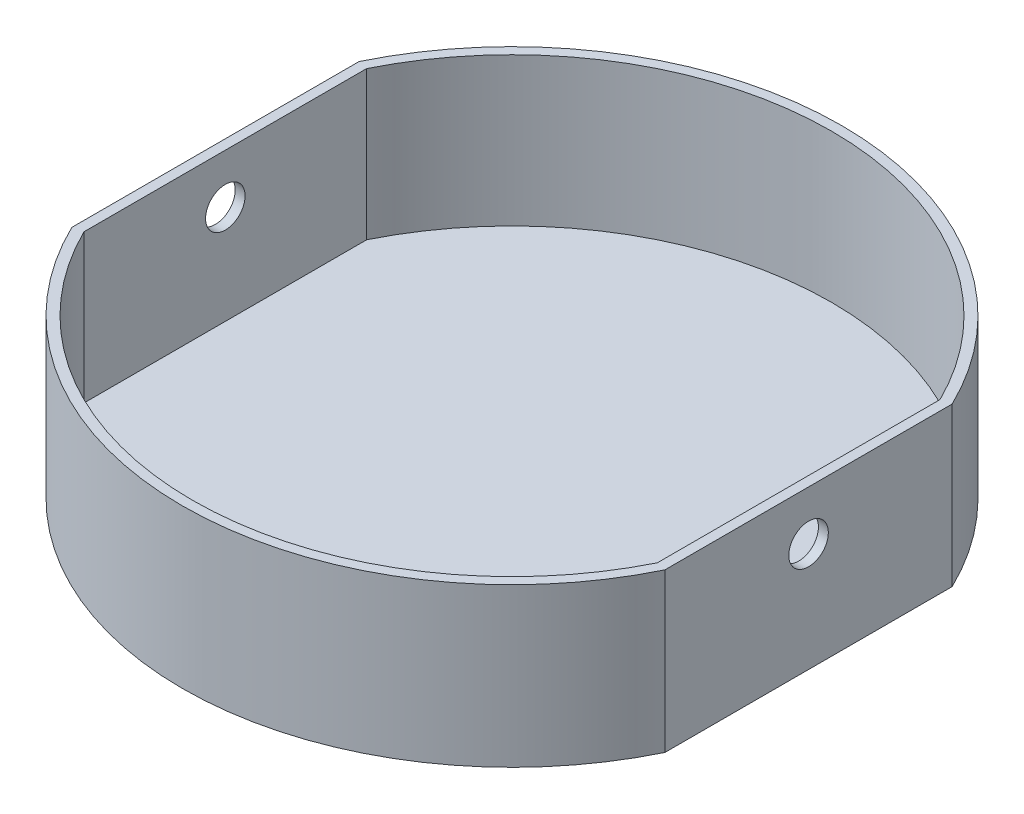
ISO-10303-21;
HEADER;
FILE_DESCRIPTION(('STEP AP214'),'2;1');
FILE_NAME('part.step','',(''),(''),'','','');
FILE_SCHEMA(('AUTOMOTIVE_DESIGN { 1 0 10303 214 1 1 1 1 }'));
ENDSEC;
DATA;
#1=APPLICATION_CONTEXT('core data for automotive mechanical design processes');
#2=APPLICATION_PROTOCOL_DEFINITION('international standard','automotive_design',2000,#1);
#3=PRODUCT_CONTEXT('',#1,'mechanical');
#4=PRODUCT('Part','Part','',(#3));
#5=PRODUCT_RELATED_PRODUCT_CATEGORY('part','',(#4));
#6=PRODUCT_DEFINITION_FORMATION('','',#4);
#7=PRODUCT_DEFINITION_CONTEXT('part definition',#1,'design');
#8=PRODUCT_DEFINITION('design','',#6,#7);
#9=PRODUCT_DEFINITION_SHAPE('','',#8);
#10=(LENGTH_UNIT() NAMED_UNIT(*) SI_UNIT(.MILLI.,.METRE.));
#11=(NAMED_UNIT(*) PLANE_ANGLE_UNIT() SI_UNIT($,.RADIAN.));
#12=(NAMED_UNIT(*) SI_UNIT($,.STERADIAN.) SOLID_ANGLE_UNIT());
#13=UNCERTAINTY_MEASURE_WITH_UNIT(LENGTH_MEASURE(1.E-05),#10,'distance_accuracy_value','');
#14=(GEOMETRIC_REPRESENTATION_CONTEXT(3) GLOBAL_UNCERTAINTY_ASSIGNED_CONTEXT((#13)) GLOBAL_UNIT_ASSIGNED_CONTEXT((#10,
#11,#12)) REPRESENTATION_CONTEXT('',''));
#15=CARTESIAN_POINT('',(0.,0.,0.));
#16=DIRECTION('',(0.,0.,1.));
#17=DIRECTION('',(1.,0.,0.));
#18=AXIS2_PLACEMENT_3D('',#15,#16,#17);
#19=CARTESIAN_POINT('',(0.,48.,0.));
#20=DIRECTION('',(0.,1.,0.));
#21=DIRECTION('',(0.,0.,1.));
#22=AXIS2_PLACEMENT_3D('',#19,#20,#21);
#23=PLANE('',#22);
#24=CARTESIAN_POINT('',(0.,48.,0.));
#25=DIRECTION('',(0.,1.,0.));
#26=DIRECTION('',(0.,0.,1.));
#27=AXIS2_PLACEMENT_3D('',#24,#25,#26);
#28=CIRCLE('',#27,100.);
#29=CARTESIAN_POINT('',(-90.0859820491556,48.,43.4110105645932));
#30=VERTEX_POINT('',#29);
#31=CARTESIAN_POINT('',(90.,48.,43.5889894354068));
#32=VERTEX_POINT('',#31);
#33=EDGE_CURVE('E209',#30,#32,#28,.T.);
#34=ORIENTED_EDGE('',*,*,#33,.T.);
#35=DIRECTION('',(0.,0.,1.));
#36=VECTOR('',#35,1.);
#37=CARTESIAN_POINT('',(90.,48.,-43.5889894354068));
#38=LINE('',#37,#36);
#39=CARTESIAN_POINT('',(90.,48.,-43.5889894354068));
#40=VERTEX_POINT('',#39);
#41=EDGE_CURVE('E233',#40,#32,#38,.T.);
#42=ORIENTED_EDGE('',*,*,#41,.F.);
#43=CARTESIAN_POINT('',(0.,48.,2.63677968348475E-13));
#44=DIRECTION('',(0.,1.,0.));
#45=DIRECTION('',(0.,0.,-1.));
#46=AXIS2_PLACEMENT_3D('',#43,#44,#45);
#47=CIRCLE('',#46,100.);
#48=CARTESIAN_POINT('',(-90.,48.,-43.5889894354068));
#49=VERTEX_POINT('',#48);
#50=EDGE_CURVE('E203',#40,#49,#47,.T.);
#51=ORIENTED_EDGE('',*,*,#50,.T.);
#52=DIRECTION('',(0.,0.,1.));
#53=VECTOR('',#52,1.);
#54=CARTESIAN_POINT('',(-90.,48.,-43.5889894354068));
#55=LINE('',#54,#53);
#56=CARTESIAN_POINT('',(-90.,48.,43.4110105645932));
#57=VERTEX_POINT('',#56);
#58=EDGE_CURVE('E226',#49,#57,#55,.T.);
#59=ORIENTED_EDGE('',*,*,#58,.T.);
#60=DIRECTION('',(-1.,0.,0.));
#61=VECTOR('',#60,1.);
#62=CARTESIAN_POINT('',(-87.,48.,43.4110105645932));
#63=LINE('',#62,#61);
#64=EDGE_CURVE('E205',#57,#30,#63,.T.);
#65=ORIENTED_EDGE('',*,*,#64,.T.);
#66=EDGE_LOOP('',(#34,#42,#51,#59,#65));
#67=FACE_BOUND('',#66,.T.);
#68=DIRECTION('',(0.,0.,1.));
#69=VECTOR('',#68,1.);
#70=CARTESIAN_POINT('',(87.,48.,-42.8952211790544));
#71=LINE('',#70,#69);
#72=CARTESIAN_POINT('',(87.,48.,-42.8952211790544));
#73=VERTEX_POINT('',#72);
#74=CARTESIAN_POINT('',(87.,48.,42.8952211790544));
#75=VERTEX_POINT('',#74);
#76=EDGE_CURVE('E200',#73,#75,#71,.T.);
#77=ORIENTED_EDGE('',*,*,#76,.T.);
#78=CARTESIAN_POINT('',(0.,48.,0.));
#79=DIRECTION('',(0.,1.,0.));
#80=DIRECTION('',(0.,0.,1.));
#81=AXIS2_PLACEMENT_3D('',#78,#79,#80);
#82=CIRCLE('',#81,97.);
#83=CARTESIAN_POINT('',(-87.,48.,42.8952211790545));
#84=VERTEX_POINT('',#83);
#85=EDGE_CURVE('E166',#84,#75,#82,.T.);
#86=ORIENTED_EDGE('',*,*,#85,.F.);
#87=DIRECTION('',(0.,0.,1.));
#88=VECTOR('',#87,1.);
#89=CARTESIAN_POINT('',(-87.,48.,-42.8952211790544));
#90=LINE('',#89,#88);
#91=CARTESIAN_POINT('',(-87.,48.,-42.8952211790544));
#92=VERTEX_POINT('',#91);
#93=EDGE_CURVE('E161',#92,#84,#90,.T.);
#94=ORIENTED_EDGE('',*,*,#93,.F.);
#95=CARTESIAN_POINT('',(0.,48.,2.63677968348475E-13));
#96=DIRECTION('',(0.,1.,0.));
#97=DIRECTION('',(0.,0.,1.));
#98=AXIS2_PLACEMENT_3D('',#95,#96,#97);
#99=CIRCLE('',#98,97.0000000000001);
#100=EDGE_CURVE('E145',#73,#92,#99,.T.);
#101=ORIENTED_EDGE('',*,*,#100,.F.);
#102=EDGE_LOOP('',(#77,#86,#94,#101));
#103=FACE_BOUND('',#102,.T.);
#104=ADVANCED_FACE('F72',(#67,#103),#23,.T.);
#105=CARTESIAN_POINT('',(0.,3.,0.));
#106=DIRECTION('',(0.,-1.,0.));
#107=DIRECTION('',(0.,0.,-1.));
#108=AXIS2_PLACEMENT_3D('',#105,#106,#107);
#109=CYLINDRICAL_SURFACE('',#108,100.);
#110=CARTESIAN_POINT('',(0.,0.,0.));
#111=DIRECTION('',(0.,1.,0.));
#112=DIRECTION('',(0.,0.,1.));
#113=AXIS2_PLACEMENT_3D('',#110,#111,#112);
#114=CIRCLE('',#113,100.);
#115=CARTESIAN_POINT('',(90.,0.,-43.5889894354068));
#116=VERTEX_POINT('',#115);
#117=CARTESIAN_POINT('',(-90.,0.,-43.5889894354068));
#118=VERTEX_POINT('',#117);
#119=EDGE_CURVE('E238',#116,#118,#114,.T.);
#120=ORIENTED_EDGE('',*,*,#119,.T.);
#121=DIRECTION('',(0.,-1.,0.));
#122=VECTOR('',#121,1.);
#123=CARTESIAN_POINT('',(-90.,48.,-43.5889894354068));
#124=LINE('',#123,#122);
#125=EDGE_CURVE('E229',#49,#118,#124,.T.);
#126=ORIENTED_EDGE('',*,*,#125,.F.);
#127=ORIENTED_EDGE('',*,*,#50,.F.);
#128=DIRECTION('',(0.,-1.,0.));
#129=VECTOR('',#128,1.);
#130=CARTESIAN_POINT('',(90.,48.,-43.5889894354068));
#131=LINE('',#130,#129);
#132=EDGE_CURVE('E236',#40,#116,#131,.T.);
#133=ORIENTED_EDGE('',*,*,#132,.T.);
#134=EDGE_LOOP('',(#120,#126,#127,#133));
#135=FACE_BOUND('',#134,.T.);
#136=ADVANCED_FACE('F259',(#135),#109,.T.);
#137=DIRECTION('',(0.,-1.,0.));
#138=VECTOR('',#137,1.);
#139=CARTESIAN_POINT('',(90.,3.,43.5889894354068));
#140=LINE('',#139,#138);
#141=CARTESIAN_POINT('',(90.,0.,43.5889894354068));
#142=VERTEX_POINT('',#141);
#143=EDGE_CURVE('E224',#142,#32,#140,.F.);
#144=ORIENTED_EDGE('',*,*,#143,.T.);
#145=ORIENTED_EDGE('',*,*,#33,.F.);
#146=DIRECTION('',(0.,-1.,0.));
#147=VECTOR('',#146,1.);
#148=CARTESIAN_POINT('',(-90.0859820491555,3.,43.4110105645932));
#149=LINE('',#148,#147);
#150=CARTESIAN_POINT('',(-90.0859820491556,0.,43.4110105645932));
#151=VERTEX_POINT('',#150);
#152=EDGE_CURVE('E222',#30,#151,#149,.T.);
#153=ORIENTED_EDGE('',*,*,#152,.T.);
#154=EDGE_CURVE('E95',#151,#142,#114,.T.);
#155=ORIENTED_EDGE('',*,*,#154,.T.);
#156=EDGE_LOOP('',(#144,#145,#153,#155));
#157=FACE_BOUND('',#156,.T.);
#158=ADVANCED_FACE('F74',(#157),#109,.T.);
#159=CARTESIAN_POINT('',(0.,0.,0.));
#160=DIRECTION('',(0.,1.,0.));
#161=DIRECTION('',(0.,0.,1.));
#162=AXIS2_PLACEMENT_3D('',#159,#160,#161);
#163=PLANE('',#162);
#164=DIRECTION('',(1.,0.,0.));
#165=VECTOR('',#164,1.);
#166=CARTESIAN_POINT('',(0.,0.,43.4110105645932));
#167=LINE('',#166,#165);
#168=CARTESIAN_POINT('',(-90.,0.,43.4110105645932));
#169=VERTEX_POINT('',#168);
#170=EDGE_CURVE('E80',#151,#169,#167,.T.);
#171=ORIENTED_EDGE('',*,*,#170,.T.);
#172=DIRECTION('',(0.,0.,-1.));
#173=VECTOR('',#172,1.);
#174=CARTESIAN_POINT('',(-90.,0.,0.));
#175=LINE('',#174,#173);
#176=EDGE_CURVE('E12',#169,#118,#175,.T.);
#177=ORIENTED_EDGE('',*,*,#176,.T.);
#178=ORIENTED_EDGE('',*,*,#119,.F.);
#179=DIRECTION('',(0.,0.,1.));
#180=VECTOR('',#179,1.);
#181=CARTESIAN_POINT('',(90.,0.,0.));
#182=LINE('',#181,#180);
#183=EDGE_CURVE('E241',#116,#142,#182,.T.);
#184=ORIENTED_EDGE('',*,*,#183,.T.);
#185=ORIENTED_EDGE('',*,*,#154,.F.);
#186=EDGE_LOOP('',(#171,#177,#178,#184,#185));
#187=FACE_BOUND('',#186,.T.);
#188=ADVANCED_FACE('F245',(#187),#163,.F.);
#189=CARTESIAN_POINT('',(90.,48.,-43.5889894354068));
#190=DIRECTION('',(1.,0.,0.));
#191=DIRECTION('',(0.,0.,-1.));
#192=AXIS2_PLACEMENT_3D('',#189,#190,#191);
#193=PLANE('',#192);
#194=CARTESIAN_POINT('',(90.,33.,0.));
#195=DIRECTION('',(1.,0.,0.));
#196=DIRECTION('',(0.,0.,-1.));
#197=AXIS2_PLACEMENT_3D('',#194,#195,#196);
#198=CIRCLE('',#197,6.);
#199=CARTESIAN_POINT('',(90.,33.,-6.00000000000001));
#200=VERTEX_POINT('',#199);
#201=EDGE_CURVE('E212',#200,#200,#198,.T.);
#202=ORIENTED_EDGE('',*,*,#201,.F.);
#203=EDGE_LOOP('',(#202));
#204=FACE_BOUND('',#203,.T.);
#205=ORIENTED_EDGE('',*,*,#41,.T.);
#206=ORIENTED_EDGE('',*,*,#143,.F.);
#207=ORIENTED_EDGE('',*,*,#183,.F.);
#208=ORIENTED_EDGE('',*,*,#132,.F.);
#209=EDGE_LOOP('',(#205,#206,#207,#208));
#210=FACE_BOUND('',#209,.T.);
#211=ADVANCED_FACE('F263',(#204,#210),#193,.T.);
#212=CARTESIAN_POINT('',(-90.,48.,-43.5889894354068));
#213=DIRECTION('',(1.,0.,0.));
#214=DIRECTION('',(0.,0.,-1.));
#215=AXIS2_PLACEMENT_3D('',#212,#213,#214);
#216=PLANE('',#215);
#217=CARTESIAN_POINT('',(-90.,33.,0.));
#218=DIRECTION('',(-1.,0.,0.));
#219=DIRECTION('',(0.,0.,1.));
#220=AXIS2_PLACEMENT_3D('',#217,#218,#219);
#221=CIRCLE('',#220,6.);
#222=CARTESIAN_POINT('',(-90.,33.,6.00000000000003));
#223=VERTEX_POINT('',#222);
#224=EDGE_CURVE('E217',#223,#223,#221,.T.);
#225=ORIENTED_EDGE('',*,*,#224,.F.);
#226=EDGE_LOOP('',(#225));
#227=FACE_BOUND('',#226,.T.);
#228=ORIENTED_EDGE('',*,*,#125,.T.);
#229=ORIENTED_EDGE('',*,*,#176,.F.);
#230=DIRECTION('',(0.,-1.,0.));
#231=VECTOR('',#230,1.);
#232=CARTESIAN_POINT('',(-90.,48.,43.4110105645932));
#233=LINE('',#232,#231);
#234=EDGE_CURVE('E231',#57,#169,#233,.T.);
#235=ORIENTED_EDGE('',*,*,#234,.F.);
#236=ORIENTED_EDGE('',*,*,#58,.F.);
#237=EDGE_LOOP('',(#228,#229,#235,#236));
#238=FACE_BOUND('',#237,.T.);
#239=ADVANCED_FACE('F257',(#227,#238),#216,.F.);
#240=CARTESIAN_POINT('',(-90.,-42.,43.4110105645932));
#241=DIRECTION('',(0.,0.,1.));
#242=DIRECTION('',(1.,0.,0.));
#243=AXIS2_PLACEMENT_3D('',#240,#241,#242);
#244=PLANE('',#243);
#245=ORIENTED_EDGE('',*,*,#152,.F.);
#246=ORIENTED_EDGE('',*,*,#64,.F.);
#247=ORIENTED_EDGE('',*,*,#234,.T.);
#248=ORIENTED_EDGE('',*,*,#170,.F.);
#249=EDGE_LOOP('',(#245,#246,#247,#248));
#250=FACE_BOUND('',#249,.T.);
#251=ADVANCED_FACE('F249',(#250),#244,.F.);
#252=CARTESIAN_POINT('',(-45.,33.,0.));
#253=DIRECTION('',(-1.,0.,0.));
#254=DIRECTION('',(0.,0.,1.));
#255=AXIS2_PLACEMENT_3D('',#252,#253,#254);
#256=CYLINDRICAL_SURFACE('',#255,6.);
#257=CARTESIAN_POINT('',(-87.,33.,0.));
#258=DIRECTION('',(1.,0.,0.));
#259=DIRECTION('',(0.,0.,-1.));
#260=AXIS2_PLACEMENT_3D('',#257,#258,#259);
#261=CIRCLE('',#260,6.);
#262=CARTESIAN_POINT('',(-87.,33.,6.00000000000003));
#263=VERTEX_POINT('',#262);
#264=EDGE_CURVE('E155',#263,#263,#261,.F.);
#265=CARTESIAN_POINT('',(-87.,33.,6.00000000000003));
#266=CARTESIAN_POINT('',(-87.03125,33.,6.00000000000003));
#267=CARTESIAN_POINT('',(-87.0625,33.,6.00000000000003));
#268=CARTESIAN_POINT('',(-87.125,33.,6.00000000000003));
#269=CARTESIAN_POINT('',(-87.15625,33.,6.00000000000003));
#270=CARTESIAN_POINT('',(-87.21875,33.,6.00000000000003));
#271=CARTESIAN_POINT('',(-87.25,33.,6.00000000000003));
#272=CARTESIAN_POINT('',(-87.3125,33.,6.00000000000003));
#273=CARTESIAN_POINT('',(-87.34375,33.,6.00000000000003));
#274=CARTESIAN_POINT('',(-87.4062499999999,33.,6.00000000000003));
#275=CARTESIAN_POINT('',(-87.4375,33.,6.00000000000003));
#276=CARTESIAN_POINT('',(-87.5,33.,6.00000000000003));
#277=CARTESIAN_POINT('',(-87.53125,33.,6.00000000000003));
#278=CARTESIAN_POINT('',(-87.59375,33.,6.00000000000003));
#279=CARTESIAN_POINT('',(-87.625,33.,6.00000000000003));
#280=CARTESIAN_POINT('',(-87.6875,33.,6.00000000000003));
#281=CARTESIAN_POINT('',(-87.71875,33.,6.00000000000003));
#282=CARTESIAN_POINT('',(-87.78125,33.,6.00000000000003));
#283=CARTESIAN_POINT('',(-87.8125,33.,6.00000000000003));
#284=CARTESIAN_POINT('',(-87.875,33.,6.00000000000003));
#285=CARTESIAN_POINT('',(-87.90625,33.,6.00000000000003));
#286=CARTESIAN_POINT('',(-87.96875,33.,6.00000000000003));
#287=CARTESIAN_POINT('',(-88.,33.,6.00000000000003));
#288=CARTESIAN_POINT('',(-88.0625,33.,6.00000000000003));
#289=CARTESIAN_POINT('',(-88.09375,33.,6.00000000000003));
#290=CARTESIAN_POINT('',(-88.15625,33.,6.00000000000003));
#291=CARTESIAN_POINT('',(-88.1875,33.,6.00000000000003));
#292=CARTESIAN_POINT('',(-88.25,33.,6.00000000000003));
#293=CARTESIAN_POINT('',(-88.28125,33.,6.00000000000003));
#294=CARTESIAN_POINT('',(-88.34375,33.,6.00000000000003));
#295=CARTESIAN_POINT('',(-88.375,33.,6.00000000000003));
#296=CARTESIAN_POINT('',(-88.4375,33.,6.00000000000003));
#297=CARTESIAN_POINT('',(-88.46875,33.,6.00000000000003));
#298=CARTESIAN_POINT('',(-88.53125,33.,6.00000000000003));
#299=CARTESIAN_POINT('',(-88.5625,33.,6.00000000000003));
#300=CARTESIAN_POINT('',(-88.625,33.,6.00000000000003));
#301=CARTESIAN_POINT('',(-88.65625,33.,6.00000000000003));
#302=CARTESIAN_POINT('',(-88.71875,33.,6.00000000000003));
#303=CARTESIAN_POINT('',(-88.75,33.,6.00000000000003));
#304=CARTESIAN_POINT('',(-88.8125,33.,6.00000000000003));
#305=CARTESIAN_POINT('',(-88.84375,33.,6.00000000000003));
#306=CARTESIAN_POINT('',(-88.90625,33.,6.00000000000003));
#307=CARTESIAN_POINT('',(-88.9375,33.,6.00000000000003));
#308=CARTESIAN_POINT('',(-89.,33.,6.00000000000003));
#309=CARTESIAN_POINT('',(-89.03125,33.,6.00000000000003));
#310=CARTESIAN_POINT('',(-89.09375,33.,6.00000000000003));
#311=CARTESIAN_POINT('',(-89.125,33.,6.00000000000003));
#312=CARTESIAN_POINT('',(-89.1875,33.,6.00000000000003));
#313=CARTESIAN_POINT('',(-89.21875,33.,6.00000000000003));
#314=CARTESIAN_POINT('',(-89.28125,33.,6.00000000000003));
#315=CARTESIAN_POINT('',(-89.3125,33.,6.00000000000003));
#316=CARTESIAN_POINT('',(-89.375,33.,6.00000000000003));
#317=CARTESIAN_POINT('',(-89.40625,33.,6.00000000000003));
#318=CARTESIAN_POINT('',(-89.46875,33.,6.00000000000003));
#319=CARTESIAN_POINT('',(-89.5,33.,6.00000000000003));
#320=CARTESIAN_POINT('',(-89.5625,33.,6.00000000000003));
#321=CARTESIAN_POINT('',(-89.59375,33.,6.00000000000003));
#322=CARTESIAN_POINT('',(-89.65625,33.,6.00000000000003));
#323=CARTESIAN_POINT('',(-89.6875,33.,6.00000000000003));
#324=CARTESIAN_POINT('',(-89.75,33.,6.00000000000003));
#325=CARTESIAN_POINT('',(-89.78125,33.,6.00000000000003));
#326=CARTESIAN_POINT('',(-89.84375,33.,6.00000000000003));
#327=CARTESIAN_POINT('',(-89.875,33.,6.00000000000003));
#328=CARTESIAN_POINT('',(-89.9375,33.,6.00000000000003));
#329=CARTESIAN_POINT('',(-89.96875,33.,6.00000000000003));
#330=CARTESIAN_POINT('',(-90.,33.,6.00000000000003));
#331=B_SPLINE_CURVE_WITH_KNOTS('',3,(#265,#266,#267,#268,#269,#270,#271,#272,#273,#274,#275,
#276,#277,#278,#279,#280,#281,#282,#283,#284,#285,#286,#287,#288,#289,#290,#291,#292,#293,#294,
#295,#296,#297,#298,#299,#300,#301,#302,#303,#304,#305,#306,#307,#308,#309,#310,#311,#312,#313,
#314,#315,#316,#317,#318,#319,#320,#321,#322,#323,#324,#325,#326,#327,#328,#329,#330),
.UNSPECIFIED.,.F.,.F.,(4,2,2,2,2,2,2,2,2,2,2,2,2,2,2,2,2,2,2,2,2,2,2,2,2,2,2,2,2,2,2,2,4),(0.,
0.0937500000000036,0.187499999999993,0.281249999999997,0.374999999999986,0.46874999999999,
0.562499999999994,0.656249999999997,0.750000000000001,0.843750000000004,0.937500000000008,
1.03125,1.125,1.21874999999999,1.31249999999999,1.40625,1.5,1.59375,1.68750000000001,
1.78125000000001,1.875,1.96875000000001,2.06249999999999,2.15625,2.25,2.34375000000001,
2.43750000000001,2.53125000000001,2.62500000000002,2.71875000000001,2.81250000000001,2.90625,
3.),.UNSPECIFIED.);
#332=EDGE_CURVE('BSEAM282',#263,#223,#331,.T.);
#333=ORIENTED_EDGE('',*,*,#264,.F.);
#334=ORIENTED_EDGE('',*,*,#224,.T.);
#335=ORIENTED_EDGE('',*,*,#332,.T.);
#336=ORIENTED_EDGE('',*,*,#332,.F.);
#337=EDGE_LOOP('',(#333,#335,#334,#336));
#338=FACE_BOUND('',#337,.T.);
#339=ADVANCED_FACE('F282',(#338),#256,.F.);
#340=CARTESIAN_POINT('',(45.,33.,0.));
#341=DIRECTION('',(1.,0.,0.));
#342=DIRECTION('',(0.,0.,-1.));
#343=AXIS2_PLACEMENT_3D('',#340,#341,#342);
#344=CYLINDRICAL_SURFACE('',#343,6.);
#345=CARTESIAN_POINT('',(87.,33.,0.));
#346=DIRECTION('',(1.,0.,0.));
#347=DIRECTION('',(0.,0.,-1.));
#348=AXIS2_PLACEMENT_3D('',#345,#346,#347);
#349=CIRCLE('',#348,6.);
#350=CARTESIAN_POINT('',(87.,33.,-6.00000000000001));
#351=VERTEX_POINT('',#350);
#352=EDGE_CURVE('E206',#351,#351,#349,.T.);
#353=CARTESIAN_POINT('',(90.,33.,-6.00000000000001));
#354=CARTESIAN_POINT('',(89.96875,33.,-6.00000000000001));
#355=CARTESIAN_POINT('',(89.9375,33.,-6.00000000000001));
#356=CARTESIAN_POINT('',(89.875,33.,-6.00000000000001));
#357=CARTESIAN_POINT('',(89.84375,33.,-6.00000000000001));
#358=CARTESIAN_POINT('',(89.78125,33.,-6.00000000000001));
#359=CARTESIAN_POINT('',(89.75,33.,-6.00000000000001));
#360=CARTESIAN_POINT('',(89.6875,33.,-6.00000000000001));
#361=CARTESIAN_POINT('',(89.65625,33.,-6.00000000000001));
#362=CARTESIAN_POINT('',(89.59375,33.,-6.00000000000001));
#363=CARTESIAN_POINT('',(89.5625,33.,-6.00000000000001));
#364=CARTESIAN_POINT('',(89.5,33.,-6.00000000000001));
#365=CARTESIAN_POINT('',(89.46875,33.,-6.00000000000001));
#366=CARTESIAN_POINT('',(89.40625,33.,-6.00000000000001));
#367=CARTESIAN_POINT('',(89.375,33.,-6.00000000000001));
#368=CARTESIAN_POINT('',(89.3125,33.,-6.00000000000001));
#369=CARTESIAN_POINT('',(89.28125,33.,-6.00000000000001));
#370=CARTESIAN_POINT('',(89.21875,33.,-6.00000000000001));
#371=CARTESIAN_POINT('',(89.1875,33.,-6.00000000000001));
#372=CARTESIAN_POINT('',(89.125,33.,-6.00000000000001));
#373=CARTESIAN_POINT('',(89.09375,33.,-6.00000000000001));
#374=CARTESIAN_POINT('',(89.03125,33.,-6.00000000000001));
#375=CARTESIAN_POINT('',(89.,33.,-6.00000000000001));
#376=CARTESIAN_POINT('',(88.9375,33.,-6.00000000000001));
#377=CARTESIAN_POINT('',(88.90625,33.,-6.00000000000001));
#378=CARTESIAN_POINT('',(88.84375,33.,-6.00000000000001));
#379=CARTESIAN_POINT('',(88.8125,33.,-6.00000000000001));
#380=CARTESIAN_POINT('',(88.75,33.,-6.00000000000001));
#381=CARTESIAN_POINT('',(88.71875,33.,-6.00000000000001));
#382=CARTESIAN_POINT('',(88.65625,33.,-6.00000000000001));
#383=CARTESIAN_POINT('',(88.625,33.,-6.00000000000001));
#384=CARTESIAN_POINT('',(88.5625,33.,-6.00000000000001));
#385=CARTESIAN_POINT('',(88.53125,33.,-6.00000000000001));
#386=CARTESIAN_POINT('',(88.46875,33.,-6.00000000000001));
#387=CARTESIAN_POINT('',(88.4375,33.,-6.00000000000001));
#388=CARTESIAN_POINT('',(88.375,33.,-6.00000000000001));
#389=CARTESIAN_POINT('',(88.34375,33.,-6.00000000000001));
#390=CARTESIAN_POINT('',(88.28125,33.,-6.00000000000001));
#391=CARTESIAN_POINT('',(88.25,33.,-6.00000000000001));
#392=CARTESIAN_POINT('',(88.1875,33.,-6.00000000000001));
#393=CARTESIAN_POINT('',(88.15625,33.,-6.00000000000001));
#394=CARTESIAN_POINT('',(88.09375,33.,-6.00000000000001));
#395=CARTESIAN_POINT('',(88.0625,33.,-6.00000000000001));
#396=CARTESIAN_POINT('',(88.,33.,-6.00000000000001));
#397=CARTESIAN_POINT('',(87.96875,33.,-6.00000000000001));
#398=CARTESIAN_POINT('',(87.90625,33.,-6.00000000000001));
#399=CARTESIAN_POINT('',(87.875,33.,-6.00000000000001));
#400=CARTESIAN_POINT('',(87.8125,33.,-6.00000000000001));
#401=CARTESIAN_POINT('',(87.78125,33.,-6.00000000000001));
#402=CARTESIAN_POINT('',(87.71875,33.,-6.00000000000001));
#403=CARTESIAN_POINT('',(87.6875,33.,-6.00000000000001));
#404=CARTESIAN_POINT('',(87.625,33.,-6.00000000000001));
#405=CARTESIAN_POINT('',(87.59375,33.,-6.00000000000001));
#406=CARTESIAN_POINT('',(87.53125,33.,-6.00000000000001));
#407=CARTESIAN_POINT('',(87.5,33.,-6.00000000000001));
#408=CARTESIAN_POINT('',(87.4375,33.,-6.00000000000001));
#409=CARTESIAN_POINT('',(87.40625,33.,-6.00000000000001));
#410=CARTESIAN_POINT('',(87.34375,33.,-6.00000000000001));
#411=CARTESIAN_POINT('',(87.3125,33.,-6.00000000000001));
#412=CARTESIAN_POINT('',(87.25,33.,-6.00000000000001));
#413=CARTESIAN_POINT('',(87.21875,33.,-6.00000000000001));
#414=CARTESIAN_POINT('',(87.15625,33.,-6.00000000000001));
#415=CARTESIAN_POINT('',(87.125,33.,-6.00000000000001));
#416=CARTESIAN_POINT('',(87.0625,33.,-6.00000000000001));
#417=CARTESIAN_POINT('',(87.03125,33.,-6.00000000000001));
#418=CARTESIAN_POINT('',(87.,33.,-6.00000000000001));
#419=B_SPLINE_CURVE_WITH_KNOTS('',3,(#353,#354,#355,#356,#357,#358,#359,#360,#361,#362,#363,
#364,#365,#366,#367,#368,#369,#370,#371,#372,#373,#374,#375,#376,#377,#378,#379,#380,#381,#382,
#383,#384,#385,#386,#387,#388,#389,#390,#391,#392,#393,#394,#395,#396,#397,#398,#399,#400,#401,
#402,#403,#404,#405,#406,#407,#408,#409,#410,#411,#412,#413,#414,#415,#416,#417,#418),
.UNSPECIFIED.,.F.,.F.,(4,2,2,2,2,2,2,2,2,2,2,2,2,2,2,2,2,2,2,2,2,2,2,2,2,2,2,2,2,2,2,2,4),(0.,
0.0937500000000036,0.187499999999993,0.281249999999997,0.374999999999986,0.46874999999999,
0.562499999999994,0.656249999999997,0.750000000000001,0.843750000000004,0.937500000000008,
1.03125,1.125,1.21874999999999,1.31249999999999,1.40625,1.5,1.59375,1.68750000000001,
1.78125000000001,1.875,1.96875000000001,2.06249999999999,2.15625,2.25,2.34375000000001,
2.43750000000001,2.53125000000001,2.62500000000002,2.71875000000001,2.81250000000001,2.90625,
3.),.UNSPECIFIED.);
#420=EDGE_CURVE('BSEAM285',#200,#351,#419,.T.);
#421=ORIENTED_EDGE('',*,*,#201,.T.);
#422=ORIENTED_EDGE('',*,*,#352,.F.);
#423=ORIENTED_EDGE('',*,*,#420,.T.);
#424=ORIENTED_EDGE('',*,*,#420,.F.);
#425=EDGE_LOOP('',(#421,#423,#422,#424));
#426=FACE_BOUND('',#425,.T.);
#427=ADVANCED_FACE('F285',(#426),#344,.F.);
#428=CARTESIAN_POINT('',(-87.,48.,-42.8952211790544));
#429=DIRECTION('',(1.,0.,0.));
#430=DIRECTION('',(0.,0.,-1.));
#431=AXIS2_PLACEMENT_3D('',#428,#429,#430);
#432=PLANE('',#431);
#433=DIRECTION('',(0.,0.,1.));
#434=VECTOR('',#433,1.);
#435=CARTESIAN_POINT('',(-87.,3.,-42.8952211790544));
#436=LINE('',#435,#434);
#437=CARTESIAN_POINT('',(-87.,3.00000000000001,-42.8952211790544));
#438=VERTEX_POINT('',#437);
#439=CARTESIAN_POINT('',(-87.,3.00000000000001,42.8952211790545));
#440=VERTEX_POINT('',#439);
#441=EDGE_CURVE('E164',#438,#440,#436,.T.);
#442=ORIENTED_EDGE('',*,*,#441,.F.);
#443=DIRECTION('',(0.,-1.,0.));
#444=VECTOR('',#443,1.);
#445=CARTESIAN_POINT('',(-87.,48.,-42.8952211790544));
#446=LINE('',#445,#444);
#447=EDGE_CURVE('E148',#92,#438,#446,.T.);
#448=ORIENTED_EDGE('',*,*,#447,.F.);
#449=ORIENTED_EDGE('',*,*,#93,.T.);
#450=DIRECTION('',(0.,-1.,0.));
#451=VECTOR('',#450,1.);
#452=CARTESIAN_POINT('',(-87.,48.,42.8952211790545));
#453=LINE('',#452,#451);
#454=EDGE_CURVE('E87',#84,#440,#453,.T.);
#455=ORIENTED_EDGE('',*,*,#454,.T.);
#456=EDGE_LOOP('',(#442,#448,#449,#455));
#457=FACE_BOUND('',#456,.T.);
#458=ORIENTED_EDGE('',*,*,#264,.T.);
#459=EDGE_LOOP('',(#458));
#460=FACE_BOUND('',#459,.T.);
#461=ADVANCED_FACE('F159',(#457,#460),#432,.T.);
#462=CARTESIAN_POINT('',(0.,3.,0.));
#463=DIRECTION('',(0.,-1.,0.));
#464=DIRECTION('',(0.,0.,-1.));
#465=AXIS2_PLACEMENT_3D('',#462,#463,#464);
#466=PLANE('',#465);
#467=CARTESIAN_POINT('',(0.,3.,2.63677968348475E-13));
#468=DIRECTION('',(0.,1.,0.));
#469=DIRECTION('',(0.,0.,1.));
#470=AXIS2_PLACEMENT_3D('',#467,#468,#469);
#471=CIRCLE('',#470,97.0000000000001);
#472=CARTESIAN_POINT('',(87.,3.00000000000001,-42.8952211790544));
#473=VERTEX_POINT('',#472);
#474=EDGE_CURVE('E156',#473,#438,#471,.T.);
#475=ORIENTED_EDGE('',*,*,#474,.T.);
#476=ORIENTED_EDGE('',*,*,#441,.T.);
#477=CARTESIAN_POINT('',(0.,3.,0.));
#478=DIRECTION('',(0.,1.,0.));
#479=DIRECTION('',(0.,0.,1.));
#480=AXIS2_PLACEMENT_3D('',#477,#478,#479);
#481=CIRCLE('',#480,97.);
#482=CARTESIAN_POINT('',(87.,3.00000000000001,42.8952211790544));
#483=VERTEX_POINT('',#482);
#484=EDGE_CURVE('E190',#440,#483,#481,.T.);
#485=ORIENTED_EDGE('',*,*,#484,.T.);
#486=DIRECTION('',(0.,0.,1.));
#487=VECTOR('',#486,1.);
#488=CARTESIAN_POINT('',(87.,3.,-42.8952211790544));
#489=LINE('',#488,#487);
#490=EDGE_CURVE('E179',#473,#483,#489,.T.);
#491=ORIENTED_EDGE('',*,*,#490,.F.);
#492=EDGE_LOOP('',(#475,#476,#485,#491));
#493=FACE_BOUND('',#492,.T.);
#494=ADVANCED_FACE('F290',(#493),#466,.F.);
#495=CARTESIAN_POINT('',(87.,48.,-42.8952211790544));
#496=DIRECTION('',(1.,0.,0.));
#497=DIRECTION('',(0.,0.,-1.));
#498=AXIS2_PLACEMENT_3D('',#495,#496,#497);
#499=PLANE('',#498);
#500=ORIENTED_EDGE('',*,*,#352,.T.);
#501=EDGE_LOOP('',(#500));
#502=FACE_BOUND('',#501,.T.);
#503=ORIENTED_EDGE('',*,*,#490,.T.);
#504=DIRECTION('',(0.,-1.,0.));
#505=VECTOR('',#504,1.);
#506=CARTESIAN_POINT('',(87.,48.,42.8952211790544));
#507=LINE('',#506,#505);
#508=EDGE_CURVE('E195',#75,#483,#507,.T.);
#509=ORIENTED_EDGE('',*,*,#508,.F.);
#510=ORIENTED_EDGE('',*,*,#76,.F.);
#511=DIRECTION('',(0.,-1.,0.));
#512=VECTOR('',#511,1.);
#513=CARTESIAN_POINT('',(87.,48.,-42.8952211790544));
#514=LINE('',#513,#512);
#515=EDGE_CURVE('E151',#73,#473,#514,.T.);
#516=ORIENTED_EDGE('',*,*,#515,.T.);
#517=EDGE_LOOP('',(#503,#509,#510,#516));
#518=FACE_BOUND('',#517,.T.);
#519=ADVANCED_FACE('F293',(#502,#518),#499,.F.);
#520=CARTESIAN_POINT('',(0.,48.,2.63677968348475E-13));
#521=DIRECTION('',(0.,-1.,0.));
#522=DIRECTION('',(0.,0.,-1.));
#523=AXIS2_PLACEMENT_3D('',#520,#521,#522);
#524=CYLINDRICAL_SURFACE('',#523,97.0000000000001);
#525=ORIENTED_EDGE('',*,*,#474,.F.);
#526=ORIENTED_EDGE('',*,*,#515,.F.);
#527=ORIENTED_EDGE('',*,*,#100,.T.);
#528=ORIENTED_EDGE('',*,*,#447,.T.);
#529=EDGE_LOOP('',(#525,#526,#527,#528));
#530=FACE_BOUND('',#529,.T.);
#531=ADVANCED_FACE('F147',(#530),#524,.F.);
#532=CARTESIAN_POINT('',(0.,48.,0.));
#533=DIRECTION('',(0.,-1.,0.));
#534=DIRECTION('',(0.,0.,-1.));
#535=AXIS2_PLACEMENT_3D('',#532,#533,#534);
#536=CYLINDRICAL_SURFACE('',#535,97.);
#537=ORIENTED_EDGE('',*,*,#484,.F.);
#538=ORIENTED_EDGE('',*,*,#454,.F.);
#539=ORIENTED_EDGE('',*,*,#85,.T.);
#540=ORIENTED_EDGE('',*,*,#508,.T.);
#541=EDGE_LOOP('',(#537,#538,#539,#540));
#542=FACE_BOUND('',#541,.T.);
#543=ADVANCED_FACE('F297',(#542),#536,.F.);
#544=CLOSED_SHELL('',(#104,#136,#158,#188,#211,#239,#251,#339,#427,#461,#494,#519,#531,#543));
#545=MANIFOLD_SOLID_BREP('B2',#544);
#546=ADVANCED_BREP_SHAPE_REPRESENTATION('',(#18,#545),#14);
#547=SHAPE_DEFINITION_REPRESENTATION(#9,#546);
ENDSEC;
END-ISO-10303-21;
